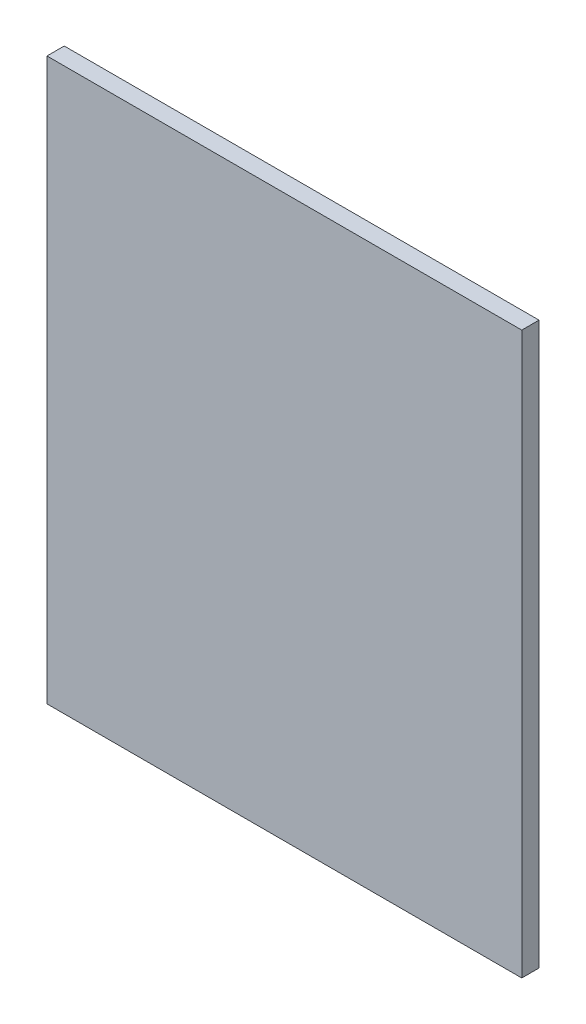
ISO-10303-21;
HEADER;
FILE_DESCRIPTION(('STEP AP214'),'2;1');
FILE_NAME('part.step','',(''),(''),'','','');
FILE_SCHEMA(('AUTOMOTIVE_DESIGN { 1 0 10303 214 1 1 1 1 }'));
ENDSEC;
DATA;
#1=APPLICATION_CONTEXT('core data for automotive mechanical design processes');
#2=APPLICATION_PROTOCOL_DEFINITION('international standard','automotive_design',2000,#1);
#3=PRODUCT_CONTEXT('',#1,'mechanical');
#4=PRODUCT('Part','Part','',(#3));
#5=PRODUCT_RELATED_PRODUCT_CATEGORY('part','',(#4));
#6=PRODUCT_DEFINITION_FORMATION('','',#4);
#7=PRODUCT_DEFINITION_CONTEXT('part definition',#1,'design');
#8=PRODUCT_DEFINITION('design','',#6,#7);
#9=PRODUCT_DEFINITION_SHAPE('','',#8);
#10=(LENGTH_UNIT() NAMED_UNIT(*) SI_UNIT(.MILLI.,.METRE.));
#11=(NAMED_UNIT(*) PLANE_ANGLE_UNIT() SI_UNIT($,.RADIAN.));
#12=(NAMED_UNIT(*) SI_UNIT($,.STERADIAN.) SOLID_ANGLE_UNIT());
#13=UNCERTAINTY_MEASURE_WITH_UNIT(LENGTH_MEASURE(1.E-05),#10,'distance_accuracy_value','');
#14=(GEOMETRIC_REPRESENTATION_CONTEXT(3) GLOBAL_UNCERTAINTY_ASSIGNED_CONTEXT((#13)) GLOBAL_UNIT_ASSIGNED_CONTEXT((#10,
#11,#12)) REPRESENTATION_CONTEXT('',''));
#15=CARTESIAN_POINT('',(0.,0.,0.));
#16=DIRECTION('',(0.,0.,1.));
#17=DIRECTION('',(1.,0.,0.));
#18=AXIS2_PLACEMENT_3D('',#15,#16,#17);
#19=CARTESIAN_POINT('',(275.,-325.,20.));
#20=DIRECTION('',(-1.,0.,0.));
#21=DIRECTION('',(0.,0.,1.));
#22=AXIS2_PLACEMENT_3D('',#19,#20,#21);
#23=PLANE('',#22);
#24=DIRECTION('',(0.,1.,0.));
#25=VECTOR('',#24,1.);
#26=CARTESIAN_POINT('',(275.,-325.,0.));
#27=LINE('',#26,#25);
#28=CARTESIAN_POINT('',(275.,-325.,0.));
#29=VERTEX_POINT('',#28);
#30=CARTESIAN_POINT('',(275.,325.,0.));
#31=VERTEX_POINT('',#30);
#32=EDGE_CURVE('E98',#29,#31,#27,.T.);
#33=ORIENTED_EDGE('',*,*,#32,.T.);
#34=DIRECTION('',(0.,0.,-1.));
#35=VECTOR('',#34,1.);
#36=CARTESIAN_POINT('',(275.,325.,20.));
#37=LINE('',#36,#35);
#38=CARTESIAN_POINT('',(275.,325.,20.));
#39=VERTEX_POINT('',#38);
#40=EDGE_CURVE('E11',#39,#31,#37,.T.);
#41=ORIENTED_EDGE('',*,*,#40,.F.);
#42=DIRECTION('',(0.,1.,0.));
#43=VECTOR('',#42,1.);
#44=CARTESIAN_POINT('',(275.,-325.,20.));
#45=LINE('',#44,#43);
#46=CARTESIAN_POINT('',(275.,-325.,20.));
#47=VERTEX_POINT('',#46);
#48=EDGE_CURVE('E86',#47,#39,#45,.T.);
#49=ORIENTED_EDGE('',*,*,#48,.F.);
#50=DIRECTION('',(0.,0.,-1.));
#51=VECTOR('',#50,1.);
#52=CARTESIAN_POINT('',(275.,-325.,20.));
#53=LINE('',#52,#51);
#54=EDGE_CURVE('E94',#47,#29,#53,.T.);
#55=ORIENTED_EDGE('',*,*,#54,.T.);
#56=EDGE_LOOP('',(#33,#41,#49,#55));
#57=FACE_BOUND('',#56,.T.);
#58=ADVANCED_FACE('F35',(#57),#23,.F.);
#59=CARTESIAN_POINT('',(-275.,325.,20.));
#60=DIRECTION('',(0.,-1.,0.));
#61=DIRECTION('',(0.,0.,-1.));
#62=AXIS2_PLACEMENT_3D('',#59,#60,#61);
#63=PLANE('',#62);
#64=DIRECTION('',(-1.,0.,0.));
#65=VECTOR('',#64,1.);
#66=CARTESIAN_POINT('',(-275.,325.,0.));
#67=LINE('',#66,#65);
#68=CARTESIAN_POINT('',(-275.,325.,0.));
#69=VERTEX_POINT('',#68);
#70=EDGE_CURVE('E90',#31,#69,#67,.T.);
#71=ORIENTED_EDGE('',*,*,#70,.T.);
#72=DIRECTION('',(0.,0.,-1.));
#73=VECTOR('',#72,1.);
#74=CARTESIAN_POINT('',(-275.,325.,20.));
#75=LINE('',#74,#73);
#76=CARTESIAN_POINT('',(-275.,325.,20.));
#77=VERTEX_POINT('',#76);
#78=EDGE_CURVE('E43',#77,#69,#75,.T.);
#79=ORIENTED_EDGE('',*,*,#78,.F.);
#80=DIRECTION('',(-1.,0.,0.));
#81=VECTOR('',#80,1.);
#82=CARTESIAN_POINT('',(-275.,325.,20.));
#83=LINE('',#82,#81);
#84=EDGE_CURVE('E81',#39,#77,#83,.T.);
#85=ORIENTED_EDGE('',*,*,#84,.F.);
#86=ORIENTED_EDGE('',*,*,#40,.T.);
#87=EDGE_LOOP('',(#71,#79,#85,#86));
#88=FACE_BOUND('',#87,.T.);
#89=ADVANCED_FACE('F89',(#88),#63,.F.);
#90=CARTESIAN_POINT('',(-275.,-325.,20.));
#91=DIRECTION('',(1.,0.,0.));
#92=DIRECTION('',(0.,0.,-1.));
#93=AXIS2_PLACEMENT_3D('',#90,#91,#92);
#94=PLANE('',#93);
#95=DIRECTION('',(0.,-1.,0.));
#96=VECTOR('',#95,1.);
#97=CARTESIAN_POINT('',(-275.,-325.,0.));
#98=LINE('',#97,#96);
#99=CARTESIAN_POINT('',(-275.,-325.,0.));
#100=VERTEX_POINT('',#99);
#101=EDGE_CURVE('E68',#69,#100,#98,.T.);
#102=ORIENTED_EDGE('',*,*,#101,.T.);
#103=DIRECTION('',(0.,0.,-1.));
#104=VECTOR('',#103,1.);
#105=CARTESIAN_POINT('',(-275.,-325.,20.));
#106=LINE('',#105,#104);
#107=CARTESIAN_POINT('',(-275.,-325.,20.));
#108=VERTEX_POINT('',#107);
#109=EDGE_CURVE('E91',#108,#100,#106,.T.);
#110=ORIENTED_EDGE('',*,*,#109,.F.);
#111=DIRECTION('',(0.,-1.,0.));
#112=VECTOR('',#111,1.);
#113=CARTESIAN_POINT('',(-275.,-325.,20.));
#114=LINE('',#113,#112);
#115=EDGE_CURVE('E84',#77,#108,#114,.T.);
#116=ORIENTED_EDGE('',*,*,#115,.F.);
#117=ORIENTED_EDGE('',*,*,#78,.T.);
#118=EDGE_LOOP('',(#102,#110,#116,#117));
#119=FACE_BOUND('',#118,.T.);
#120=ADVANCED_FACE('F92',(#119),#94,.F.);
#121=CARTESIAN_POINT('',(-275.,-325.,20.));
#122=DIRECTION('',(0.,1.,0.));
#123=DIRECTION('',(0.,0.,1.));
#124=AXIS2_PLACEMENT_3D('',#121,#122,#123);
#125=PLANE('',#124);
#126=DIRECTION('',(1.,0.,0.));
#127=VECTOR('',#126,1.);
#128=CARTESIAN_POINT('',(-275.,-325.,0.));
#129=LINE('',#128,#127);
#130=EDGE_CURVE('E74',#100,#29,#129,.T.);
#131=ORIENTED_EDGE('',*,*,#130,.T.);
#132=ORIENTED_EDGE('',*,*,#54,.F.);
#133=DIRECTION('',(1.,0.,0.));
#134=VECTOR('',#133,1.);
#135=CARTESIAN_POINT('',(-275.,-325.,20.));
#136=LINE('',#135,#134);
#137=EDGE_CURVE('E51',#108,#47,#136,.T.);
#138=ORIENTED_EDGE('',*,*,#137,.F.);
#139=ORIENTED_EDGE('',*,*,#109,.T.);
#140=EDGE_LOOP('',(#131,#132,#138,#139));
#141=FACE_BOUND('',#140,.T.);
#142=ADVANCED_FACE('F105',(#141),#125,.F.);
#143=CARTESIAN_POINT('',(0.,0.,20.));
#144=DIRECTION('',(0.,0.,-1.));
#145=DIRECTION('',(-1.,0.,0.));
#146=AXIS2_PLACEMENT_3D('',#143,#144,#145);
#147=PLANE('',#146);
#148=ORIENTED_EDGE('',*,*,#48,.T.);
#149=ORIENTED_EDGE('',*,*,#84,.T.);
#150=ORIENTED_EDGE('',*,*,#115,.T.);
#151=ORIENTED_EDGE('',*,*,#137,.T.);
#152=EDGE_LOOP('',(#148,#149,#150,#151));
#153=FACE_BOUND('',#152,.T.);
#154=ADVANCED_FACE('F82',(#153),#147,.F.);
#155=CARTESIAN_POINT('',(0.,0.,0.));
#156=DIRECTION('',(0.,0.,-1.));
#157=DIRECTION('',(-1.,0.,0.));
#158=AXIS2_PLACEMENT_3D('',#155,#156,#157);
#159=PLANE('',#158);
#160=ORIENTED_EDGE('',*,*,#32,.F.);
#161=ORIENTED_EDGE('',*,*,#130,.F.);
#162=ORIENTED_EDGE('',*,*,#101,.F.);
#163=ORIENTED_EDGE('',*,*,#70,.F.);
#164=EDGE_LOOP('',(#160,#161,#162,#163));
#165=FACE_BOUND('',#164,.T.);
#166=ADVANCED_FACE('F108',(#165),#159,.T.);
#167=CLOSED_SHELL('',(#58,#89,#120,#142,#154,#166));
#168=MANIFOLD_SOLID_BREP('B2',#167);
#169=ADVANCED_BREP_SHAPE_REPRESENTATION('',(#18,#168),#14);
#170=SHAPE_DEFINITION_REPRESENTATION(#9,#169);
ENDSEC;
END-ISO-10303-21;
